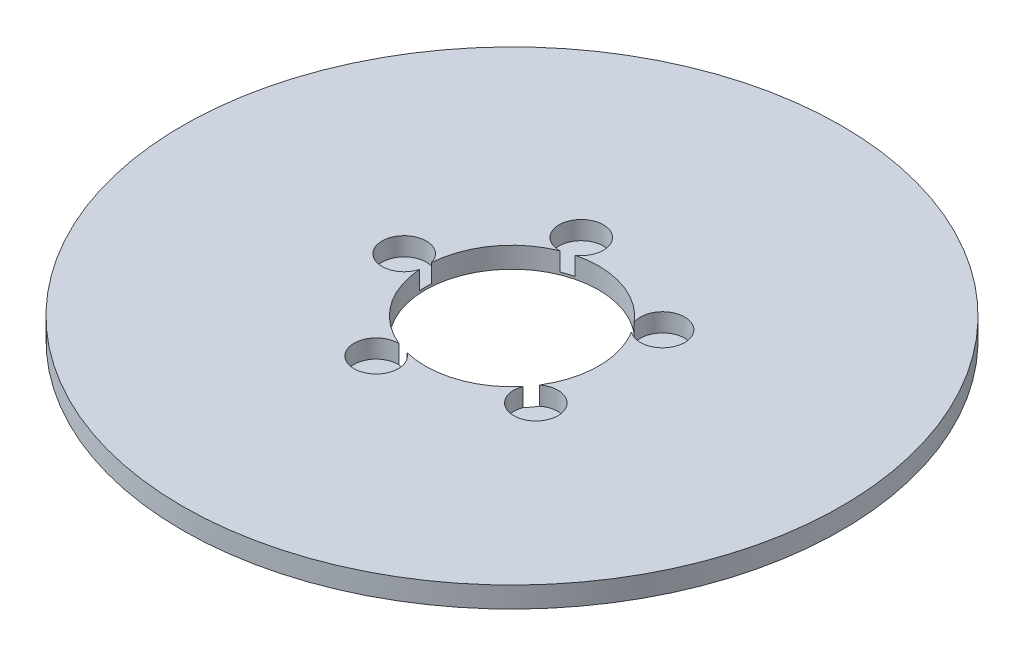
ISO-10303-21;
HEADER;
FILE_DESCRIPTION(('STEP AP214'),'2;1');
FILE_NAME('part.step','',(''),(''),'','','');
FILE_SCHEMA(('AUTOMOTIVE_DESIGN { 1 0 10303 214 1 1 1 1 }'));
ENDSEC;
DATA;
#1=APPLICATION_CONTEXT('core data for automotive mechanical design processes');
#2=APPLICATION_PROTOCOL_DEFINITION('international standard','automotive_design',2000,#1);
#3=PRODUCT_CONTEXT('',#1,'mechanical');
#4=PRODUCT('Part','Part','',(#3));
#5=PRODUCT_RELATED_PRODUCT_CATEGORY('part','',(#4));
#6=PRODUCT_DEFINITION_FORMATION('','',#4);
#7=PRODUCT_DEFINITION_CONTEXT('part definition',#1,'design');
#8=PRODUCT_DEFINITION('design','',#6,#7);
#9=PRODUCT_DEFINITION_SHAPE('','',#8);
#10=(LENGTH_UNIT() NAMED_UNIT(*) SI_UNIT(.MILLI.,.METRE.));
#11=(NAMED_UNIT(*) PLANE_ANGLE_UNIT() SI_UNIT($,.RADIAN.));
#12=(NAMED_UNIT(*) SI_UNIT($,.STERADIAN.) SOLID_ANGLE_UNIT());
#13=UNCERTAINTY_MEASURE_WITH_UNIT(LENGTH_MEASURE(1.E-05),#10,'distance_accuracy_value','');
#14=(GEOMETRIC_REPRESENTATION_CONTEXT(3) GLOBAL_UNCERTAINTY_ASSIGNED_CONTEXT((#13)) GLOBAL_UNIT_ASSIGNED_CONTEXT((#10,
#11,#12)) REPRESENTATION_CONTEXT('',''));
#15=CARTESIAN_POINT('',(0.,0.,0.));
#16=DIRECTION('',(0.,0.,1.));
#17=DIRECTION('',(1.,0.,0.));
#18=AXIS2_PLACEMENT_3D('',#15,#16,#17);
#19=CARTESIAN_POINT('',(0.,6.,0.));
#20=DIRECTION('',(0.,-1.,0.));
#21=DIRECTION('',(0.,0.,-1.));
#22=AXIS2_PLACEMENT_3D('',#19,#20,#21);
#23=CYLINDRICAL_SURFACE('',#22,95.);
#24=CARTESIAN_POINT('',(0.,6.,0.));
#25=DIRECTION('',(0.,1.,0.));
#26=DIRECTION('',(0.,0.,1.));
#27=AXIS2_PLACEMENT_3D('',#24,#25,#26);
#28=CIRCLE('',#27,95.);
#29=CARTESIAN_POINT('',(0.,6.,95.));
#30=VERTEX_POINT('',#29);
#31=EDGE_CURVE('E157',#30,#30,#28,.T.);
#32=ORIENTED_EDGE('',*,*,#31,.F.);
#33=EDGE_LOOP('',(#32));
#34=FACE_BOUND('',#33,.T.);
#35=CARTESIAN_POINT('',(0.,0.,0.));
#36=DIRECTION('',(0.,1.,0.));
#37=DIRECTION('',(0.,0.,1.));
#38=AXIS2_PLACEMENT_3D('',#35,#36,#37);
#39=CIRCLE('',#38,95.);
#40=CARTESIAN_POINT('',(0.,0.,95.));
#41=VERTEX_POINT('',#40);
#42=EDGE_CURVE('E150',#41,#41,#39,.T.);
#43=ORIENTED_EDGE('',*,*,#42,.T.);
#44=EDGE_LOOP('',(#43));
#45=FACE_BOUND('',#44,.T.);
#46=ADVANCED_FACE('F39',(#34,#45),#23,.T.);
#47=CARTESIAN_POINT('',(0.,6.,0.));
#48=DIRECTION('',(0.,1.,0.));
#49=DIRECTION('',(0.,0.,1.));
#50=AXIS2_PLACEMENT_3D('',#47,#48,#49);
#51=PLANE('',#50);
#52=CARTESIAN_POINT('',(-9.60448400432679,6.,-29.5595623031785));
#53=DIRECTION('',(0.,1.,0.));
#54=DIRECTION('',(-0.95105651629515,0.,0.309016994374958));
#55=AXIS2_PLACEMENT_3D('',#52,#53,#54);
#56=CIRCLE('',#55,6.37747740804192);
#57=CARTESIAN_POINT('',(-6.06808372666005,6.,-24.2523887459822));
#58=VERTEX_POINT('',#57);
#59=CARTESIAN_POINT('',(-9.34601357959476,6.,-23.1873247738938));
#60=VERTEX_POINT('',#59);
#61=EDGE_CURVE('E194',#58,#60,#56,.T.);
#62=ORIENTED_EDGE('',*,*,#61,.F.);
#63=CARTESIAN_POINT('',(0.,6.,0.));
#64=DIRECTION('',(0.,1.,0.));
#65=DIRECTION('',(0.,0.,1.));
#66=AXIS2_PLACEMENT_3D('',#63,#64,#65);
#67=CIRCLE('',#66,25.);
#68=CARTESIAN_POINT('',(19.16437929591,6.,-16.053864525481));
#69=VERTEX_POINT('',#68);
#70=EDGE_CURVE('E147',#69,#58,#67,.T.);
#71=ORIENTED_EDGE('',*,*,#70,.F.);
#72=CARTESIAN_POINT('',(25.1448655677312,6.,-18.2688141959347));
#73=DIRECTION('',(0.,1.,0.));
#74=DIRECTION('',(-0.58778525229248,0.,-0.809016994374942));
#75=AXIS2_PLACEMENT_3D('',#72,#73,#74);
#76=CIRCLE('',#75,6.37747740804192);
#77=CARTESIAN_POINT('',(21.1902513577616,6.,-13.2654908463608));
#78=VERTEX_POINT('',#77);
#79=EDGE_CURVE('E254',#78,#69,#76,.T.);
#80=ORIENTED_EDGE('',*,*,#79,.F.);
#81=CARTESIAN_POINT('',(21.1902513577618,6.,13.2654908463605));
#82=VERTEX_POINT('',#81);
#83=EDGE_CURVE('E144',#82,#78,#67,.T.);
#84=ORIENTED_EDGE('',*,*,#83,.F.);
#85=CARTESIAN_POINT('',(25.1448655677315,6.,18.2688141959344));
#86=DIRECTION('',(0.,1.,0.));
#87=DIRECTION('',(0.587785252292469,0.,-0.809016994374951));
#88=AXIS2_PLACEMENT_3D('',#85,#86,#87);
#89=CIRCLE('',#88,6.37747740804192);
#90=CARTESIAN_POINT('',(19.1643792959102,6.,16.0538645254807));
#91=VERTEX_POINT('',#90);
#92=EDGE_CURVE('E141',#91,#82,#89,.T.);
#93=ORIENTED_EDGE('',*,*,#92,.F.);
#94=CARTESIAN_POINT('',(-6.06808372665973,6.,24.2523887459823));
#95=VERTEX_POINT('',#94);
#96=EDGE_CURVE('E134',#95,#91,#67,.T.);
#97=ORIENTED_EDGE('',*,*,#96,.F.);
#98=CARTESIAN_POINT('',(-9.60448400432638,6.,29.5595623031786));
#99=DIRECTION('',(0.,1.,0.));
#100=DIRECTION('',(0.951056516295155,0.,0.309016994374945));
#101=AXIS2_PLACEMENT_3D('',#98,#99,#100);
#102=CIRCLE('',#101,6.37747740804192);
#103=CARTESIAN_POINT('',(-9.34601357959441,6.,23.187324773894));
#104=VERTEX_POINT('',#103);
#105=EDGE_CURVE('E111',#104,#95,#102,.T.);
#106=ORIENTED_EDGE('',*,*,#105,.F.);
#107=CARTESIAN_POINT('',(-24.9405333474176,6.,1.72330970703188));
#108=VERTEX_POINT('',#107);
#109=EDGE_CURVE('E145',#108,#104,#67,.T.);
#110=ORIENTED_EDGE('',*,*,#109,.F.);
#111=CARTESIAN_POINT('',(-31.0807631268098,6.,0.));
#112=DIRECTION('',(0.,1.,0.));
#113=DIRECTION('',(0.,0.,1.));
#114=AXIS2_PLACEMENT_3D('',#111,#112,#113);
#115=CIRCLE('',#114,6.37747740804192);
#116=CARTESIAN_POINT('',(-24.9405333474176,6.,-1.72330970703188));
#117=VERTEX_POINT('',#116);
#118=EDGE_CURVE('E153',#117,#108,#115,.T.);
#119=ORIENTED_EDGE('',*,*,#118,.F.);
#120=EDGE_CURVE('E146',#60,#117,#67,.T.);
#121=ORIENTED_EDGE('',*,*,#120,.F.);
#122=EDGE_LOOP('',(#62,#71,#80,#84,#93,#97,#106,#110,#119,#121));
#123=FACE_BOUND('',#122,.T.);
#124=ORIENTED_EDGE('',*,*,#31,.T.);
#125=EDGE_LOOP('',(#124));
#126=FACE_BOUND('',#125,.T.);
#127=ADVANCED_FACE('F139',(#123,#126),#51,.T.);
#128=CARTESIAN_POINT('',(0.,0.,0.));
#129=DIRECTION('',(0.,1.,0.));
#130=DIRECTION('',(0.,0.,1.));
#131=AXIS2_PLACEMENT_3D('',#128,#129,#130);
#132=PLANE('',#131);
#133=CARTESIAN_POINT('',(0.,0.,0.));
#134=DIRECTION('',(0.,1.,0.));
#135=DIRECTION('',(0.,0.,1.));
#136=AXIS2_PLACEMENT_3D('',#133,#134,#135);
#137=CIRCLE('',#136,25.);
#138=CARTESIAN_POINT('',(0.,0.,25.));
#139=VERTEX_POINT('',#138);
#140=EDGE_CURVE('E154',#139,#139,#137,.T.);
#141=ORIENTED_EDGE('',*,*,#140,.T.);
#142=EDGE_LOOP('',(#141));
#143=FACE_BOUND('',#142,.T.);
#144=ORIENTED_EDGE('',*,*,#42,.F.);
#145=EDGE_LOOP('',(#144));
#146=FACE_BOUND('',#145,.T.);
#147=ADVANCED_FACE('F213',(#143,#146),#132,.F.);
#148=CARTESIAN_POINT('',(0.,6.,0.));
#149=DIRECTION('',(0.,-1.,0.));
#150=DIRECTION('',(0.,0.,-1.));
#151=AXIS2_PLACEMENT_3D('',#148,#149,#150);
#152=CYLINDRICAL_SURFACE('',#151,25.);
#153=DIRECTION('',(0.,1.,0.));
#154=VECTOR('',#153,1.);
#155=CARTESIAN_POINT('',(-6.06808372666005,3.35191966016645,-24.2523887459822));
#156=LINE('',#155,#154);
#157=CARTESIAN_POINT('',(-6.06808372666005,0.7038393203329,-24.2523887459822));
#158=VERTEX_POINT('',#157);
#159=EDGE_CURVE('E11',#158,#58,#156,.T.);
#160=ORIENTED_EDGE('',*,*,#159,.F.);
#161=CARTESIAN_POINT('',(0.,0.7038393203329,0.));
#162=DIRECTION('',(0.,1.,0.));
#163=DIRECTION('',(0.,0.,1.));
#164=AXIS2_PLACEMENT_3D('',#161,#162,#163);
#165=CIRCLE('',#164,25.);
#166=CARTESIAN_POINT('',(-9.34601357959476,0.7038393203329,-23.1873247738938));
#167=VERTEX_POINT('',#166);
#168=EDGE_CURVE('E189',#158,#167,#165,.T.);
#169=ORIENTED_EDGE('',*,*,#168,.T.);
#170=DIRECTION('',(0.,1.,0.));
#171=VECTOR('',#170,1.);
#172=CARTESIAN_POINT('',(-9.34601357959476,3.35191966016645,-23.1873247738938));
#173=LINE('',#172,#171);
#174=EDGE_CURVE('E46',#60,#167,#173,.F.);
#175=ORIENTED_EDGE('',*,*,#174,.F.);
#176=ORIENTED_EDGE('',*,*,#120,.T.);
#177=DIRECTION('',(0.,1.,0.));
#178=VECTOR('',#177,1.);
#179=CARTESIAN_POINT('',(-24.9405333474176,3.35191966016645,-1.72330970703188));
#180=LINE('',#179,#178);
#181=CARTESIAN_POINT('',(-24.9405333474176,0.7038393203329,-1.72330970703188));
#182=VERTEX_POINT('',#181);
#183=EDGE_CURVE('E168',#182,#117,#180,.T.);
#184=ORIENTED_EDGE('',*,*,#183,.F.);
#185=CARTESIAN_POINT('',(0.,0.7038393203329,0.));
#186=DIRECTION('',(0.,1.,0.));
#187=DIRECTION('',(0.,0.,1.));
#188=AXIS2_PLACEMENT_3D('',#185,#186,#187);
#189=CIRCLE('',#188,25.);
#190=CARTESIAN_POINT('',(-24.9405333474176,0.7038393203329,1.72330970703188));
#191=VERTEX_POINT('',#190);
#192=EDGE_CURVE('E165',#182,#191,#189,.T.);
#193=ORIENTED_EDGE('',*,*,#192,.T.);
#194=DIRECTION('',(0.,1.,0.));
#195=VECTOR('',#194,1.);
#196=CARTESIAN_POINT('',(-24.9405333474176,3.35191966016645,1.72330970703188));
#197=LINE('',#196,#195);
#198=EDGE_CURVE('E170',#108,#191,#197,.F.);
#199=ORIENTED_EDGE('',*,*,#198,.F.);
#200=ORIENTED_EDGE('',*,*,#109,.T.);
#201=DIRECTION('',(0.,1.,0.));
#202=VECTOR('',#201,1.);
#203=CARTESIAN_POINT('',(-9.34601357959444,3.35191966016645,23.187324773894));
#204=LINE('',#203,#202);
#205=CARTESIAN_POINT('',(-9.34601357959441,0.7038393203329,23.187324773894));
#206=VERTEX_POINT('',#205);
#207=EDGE_CURVE('E121',#206,#104,#204,.T.);
#208=ORIENTED_EDGE('',*,*,#207,.F.);
#209=CARTESIAN_POINT('',(0.,0.7038393203329,0.));
#210=DIRECTION('',(0.,1.,0.));
#211=DIRECTION('',(0.,0.,1.));
#212=AXIS2_PLACEMENT_3D('',#209,#210,#211);
#213=CIRCLE('',#212,25.);
#214=CARTESIAN_POINT('',(-6.06808372665973,0.7038393203329,24.2523887459823));
#215=VERTEX_POINT('',#214);
#216=EDGE_CURVE('E136',#206,#215,#213,.T.);
#217=ORIENTED_EDGE('',*,*,#216,.T.);
#218=DIRECTION('',(0.,1.,0.));
#219=VECTOR('',#218,1.);
#220=CARTESIAN_POINT('',(-6.06808372665971,3.35191966016645,24.2523887459823));
#221=LINE('',#220,#219);
#222=EDGE_CURVE('E117',#95,#215,#221,.F.);
#223=ORIENTED_EDGE('',*,*,#222,.F.);
#224=ORIENTED_EDGE('',*,*,#96,.T.);
#225=DIRECTION('',(0.,1.,0.));
#226=VECTOR('',#225,1.);
#227=CARTESIAN_POINT('',(19.1643792959102,3.35191966016645,16.0538645254807));
#228=LINE('',#227,#226);
#229=CARTESIAN_POINT('',(19.1643792959102,0.7038393203329,16.0538645254807));
#230=VERTEX_POINT('',#229);
#231=EDGE_CURVE('E182',#230,#91,#228,.T.);
#232=ORIENTED_EDGE('',*,*,#231,.F.);
#233=CARTESIAN_POINT('',(0.,0.7038393203329,0.));
#234=DIRECTION('',(0.,1.,0.));
#235=DIRECTION('',(0.,0.,1.));
#236=AXIS2_PLACEMENT_3D('',#233,#234,#235);
#237=CIRCLE('',#236,25.);
#238=CARTESIAN_POINT('',(21.1902513577618,0.7038393203329,13.2654908463605));
#239=VERTEX_POINT('',#238);
#240=EDGE_CURVE('E174',#230,#239,#237,.T.);
#241=ORIENTED_EDGE('',*,*,#240,.T.);
#242=DIRECTION('',(0.,1.,0.));
#243=VECTOR('',#242,1.);
#244=CARTESIAN_POINT('',(21.1902513577618,3.35191966016645,13.2654908463605));
#245=LINE('',#244,#243);
#246=EDGE_CURVE('E177',#82,#239,#245,.F.);
#247=ORIENTED_EDGE('',*,*,#246,.F.);
#248=ORIENTED_EDGE('',*,*,#83,.T.);
#249=DIRECTION('',(0.,1.,0.));
#250=VECTOR('',#249,1.);
#251=CARTESIAN_POINT('',(21.1902513577616,3.35191966016645,-13.2654908463608));
#252=LINE('',#251,#250);
#253=CARTESIAN_POINT('',(21.1902513577616,0.7038393203329,-13.2654908463608));
#254=VERTEX_POINT('',#253);
#255=EDGE_CURVE('E187',#254,#78,#252,.T.);
#256=ORIENTED_EDGE('',*,*,#255,.F.);
#257=CARTESIAN_POINT('',(0.,0.7038393203329,0.));
#258=DIRECTION('',(0.,1.,0.));
#259=DIRECTION('',(0.,0.,1.));
#260=AXIS2_PLACEMENT_3D('',#257,#258,#259);
#261=CIRCLE('',#260,25.);
#262=CARTESIAN_POINT('',(19.16437929591,0.7038393203329,-16.053864525481));
#263=VERTEX_POINT('',#262);
#264=EDGE_CURVE('E181',#254,#263,#261,.T.);
#265=ORIENTED_EDGE('',*,*,#264,.T.);
#266=DIRECTION('',(0.,1.,0.));
#267=VECTOR('',#266,1.);
#268=CARTESIAN_POINT('',(19.16437929591,3.35191966016645,-16.053864525481));
#269=LINE('',#268,#267);
#270=EDGE_CURVE('E186',#69,#263,#269,.F.);
#271=ORIENTED_EDGE('',*,*,#270,.F.);
#272=ORIENTED_EDGE('',*,*,#70,.T.);
#273=EDGE_LOOP('',(#160,#169,#175,#176,#184,#193,#199,#200,#208,#217,#223,#224,#232,#241,#247,
#248,#256,#265,#271,#272));
#274=FACE_BOUND('',#273,.T.);
#275=ORIENTED_EDGE('',*,*,#140,.F.);
#276=EDGE_LOOP('',(#275));
#277=FACE_BOUND('',#276,.T.);
#278=ADVANCED_FACE('F135',(#274,#277),#152,.F.);
#279=CARTESIAN_POINT('',(-31.0807631268098,0.7038393203329,0.));
#280=DIRECTION('',(0.,1.,0.));
#281=DIRECTION('',(0.,0.,1.));
#282=AXIS2_PLACEMENT_3D('',#279,#280,#281);
#283=CYLINDRICAL_SURFACE('',#282,6.37747740804192);
#284=ORIENTED_EDGE('',*,*,#183,.T.);
#285=ORIENTED_EDGE('',*,*,#118,.T.);
#286=ORIENTED_EDGE('',*,*,#198,.T.);
#287=CARTESIAN_POINT('',(-31.0807631268098,0.7038393203329,0.));
#288=DIRECTION('',(0.,1.,0.));
#289=DIRECTION('',(0.,0.,1.));
#290=AXIS2_PLACEMENT_3D('',#287,#288,#289);
#291=CIRCLE('',#290,6.37747740804192);
#292=EDGE_CURVE('E158',#182,#191,#291,.T.);
#293=ORIENTED_EDGE('',*,*,#292,.F.);
#294=EDGE_LOOP('',(#284,#285,#286,#293));
#295=FACE_BOUND('',#294,.T.);
#296=ADVANCED_FACE('F221',(#295),#283,.F.);
#297=CARTESIAN_POINT('',(-31.0807631268098,0.7038393203329,0.));
#298=DIRECTION('',(0.,1.,0.));
#299=DIRECTION('',(0.,0.,1.));
#300=AXIS2_PLACEMENT_3D('',#297,#298,#299);
#301=PLANE('',#300);
#302=ORIENTED_EDGE('',*,*,#292,.T.);
#303=ORIENTED_EDGE('',*,*,#192,.F.);
#304=EDGE_LOOP('',(#302,#303));
#305=FACE_BOUND('',#304,.T.);
#306=ADVANCED_FACE('F227',(#305),#301,.T.);
#307=CARTESIAN_POINT('',(-9.60448400432638,0.7038393203329,29.5595623031786));
#308=DIRECTION('',(0.,1.,0.));
#309=DIRECTION('',(0.,0.,1.));
#310=AXIS2_PLACEMENT_3D('',#307,#308,#309);
#311=CYLINDRICAL_SURFACE('',#310,6.37747740804192);
#312=ORIENTED_EDGE('',*,*,#207,.T.);
#313=ORIENTED_EDGE('',*,*,#105,.T.);
#314=ORIENTED_EDGE('',*,*,#222,.T.);
#315=CARTESIAN_POINT('',(-9.60448400432638,0.7038393203329,29.5595623031786));
#316=DIRECTION('',(0.,1.,0.));
#317=DIRECTION('',(0.951056516295155,0.,0.309016994374945));
#318=AXIS2_PLACEMENT_3D('',#315,#316,#317);
#319=CIRCLE('',#318,6.37747740804192);
#320=EDGE_CURVE('E127',#206,#215,#319,.T.);
#321=ORIENTED_EDGE('',*,*,#320,.F.);
#322=EDGE_LOOP('',(#312,#313,#314,#321));
#323=FACE_BOUND('',#322,.T.);
#324=ADVANCED_FACE('F116',(#323),#311,.F.);
#325=CARTESIAN_POINT('',(-9.60448400432638,0.7038393203329,29.5595623031786));
#326=DIRECTION('',(0.,1.,0.));
#327=DIRECTION('',(0.951056516295155,0.,0.309016994374945));
#328=AXIS2_PLACEMENT_3D('',#325,#326,#327);
#329=PLANE('',#328);
#330=ORIENTED_EDGE('',*,*,#320,.T.);
#331=ORIENTED_EDGE('',*,*,#216,.F.);
#332=EDGE_LOOP('',(#330,#331));
#333=FACE_BOUND('',#332,.T.);
#334=ADVANCED_FACE('F234',(#333),#329,.T.);
#335=CARTESIAN_POINT('',(25.1448655677315,0.7038393203329,18.2688141959344));
#336=DIRECTION('',(0.,1.,0.));
#337=DIRECTION('',(0.,0.,1.));
#338=AXIS2_PLACEMENT_3D('',#335,#336,#337);
#339=CYLINDRICAL_SURFACE('',#338,6.37747740804192);
#340=ORIENTED_EDGE('',*,*,#231,.T.);
#341=ORIENTED_EDGE('',*,*,#92,.T.);
#342=ORIENTED_EDGE('',*,*,#246,.T.);
#343=CARTESIAN_POINT('',(25.1448655677315,0.7038393203329,18.2688141959344));
#344=DIRECTION('',(0.,1.,0.));
#345=DIRECTION('',(0.587785252292469,0.,-0.809016994374951));
#346=AXIS2_PLACEMENT_3D('',#343,#344,#345);
#347=CIRCLE('',#346,6.37747740804192);
#348=EDGE_CURVE('E130',#230,#239,#347,.T.);
#349=ORIENTED_EDGE('',*,*,#348,.F.);
#350=EDGE_LOOP('',(#340,#341,#342,#349));
#351=FACE_BOUND('',#350,.T.);
#352=ADVANCED_FACE('F240',(#351),#339,.F.);
#353=CARTESIAN_POINT('',(25.1448655677315,0.7038393203329,18.2688141959344));
#354=DIRECTION('',(0.,1.,0.));
#355=DIRECTION('',(0.587785252292469,0.,-0.809016994374951));
#356=AXIS2_PLACEMENT_3D('',#353,#354,#355);
#357=PLANE('',#356);
#358=ORIENTED_EDGE('',*,*,#348,.T.);
#359=ORIENTED_EDGE('',*,*,#240,.F.);
#360=EDGE_LOOP('',(#358,#359));
#361=FACE_BOUND('',#360,.T.);
#362=ADVANCED_FACE('F245',(#361),#357,.T.);
#363=CARTESIAN_POINT('',(25.1448655677312,0.7038393203329,-18.2688141959347));
#364=DIRECTION('',(0.,1.,0.));
#365=DIRECTION('',(0.,0.,1.));
#366=AXIS2_PLACEMENT_3D('',#363,#364,#365);
#367=CYLINDRICAL_SURFACE('',#366,6.37747740804192);
#368=ORIENTED_EDGE('',*,*,#255,.T.);
#369=ORIENTED_EDGE('',*,*,#79,.T.);
#370=ORIENTED_EDGE('',*,*,#270,.T.);
#371=CARTESIAN_POINT('',(25.1448655677312,0.7038393203329,-18.2688141959347));
#372=DIRECTION('',(0.,1.,0.));
#373=DIRECTION('',(-0.58778525229248,0.,-0.809016994374942));
#374=AXIS2_PLACEMENT_3D('',#371,#372,#373);
#375=CIRCLE('',#374,6.37747740804192);
#376=EDGE_CURVE('E56',#254,#263,#375,.T.);
#377=ORIENTED_EDGE('',*,*,#376,.F.);
#378=EDGE_LOOP('',(#368,#369,#370,#377));
#379=FACE_BOUND('',#378,.T.);
#380=ADVANCED_FACE('F266',(#379),#367,.F.);
#381=CARTESIAN_POINT('',(25.1448655677312,0.7038393203329,-18.2688141959347));
#382=DIRECTION('',(0.,1.,0.));
#383=DIRECTION('',(-0.58778525229248,0.,-0.809016994374942));
#384=AXIS2_PLACEMENT_3D('',#381,#382,#383);
#385=PLANE('',#384);
#386=ORIENTED_EDGE('',*,*,#376,.T.);
#387=ORIENTED_EDGE('',*,*,#264,.F.);
#388=EDGE_LOOP('',(#386,#387));
#389=FACE_BOUND('',#388,.T.);
#390=ADVANCED_FACE('F204',(#389),#385,.T.);
#391=CARTESIAN_POINT('',(-9.60448400432679,0.7038393203329,-29.5595623031785));
#392=DIRECTION('',(0.,1.,0.));
#393=DIRECTION('',(0.,0.,1.));
#394=AXIS2_PLACEMENT_3D('',#391,#392,#393);
#395=CYLINDRICAL_SURFACE('',#394,6.37747740804192);
#396=ORIENTED_EDGE('',*,*,#159,.T.);
#397=ORIENTED_EDGE('',*,*,#61,.T.);
#398=ORIENTED_EDGE('',*,*,#174,.T.);
#399=CARTESIAN_POINT('',(-9.60448400432679,0.7038393203329,-29.5595623031785));
#400=DIRECTION('',(0.,1.,0.));
#401=DIRECTION('',(-0.95105651629515,0.,0.309016994374958));
#402=AXIS2_PLACEMENT_3D('',#399,#400,#401);
#403=CIRCLE('',#402,6.37747740804192);
#404=EDGE_CURVE('E55',#158,#167,#403,.T.);
#405=ORIENTED_EDGE('',*,*,#404,.F.);
#406=EDGE_LOOP('',(#396,#397,#398,#405));
#407=FACE_BOUND('',#406,.T.);
#408=ADVANCED_FACE('F193',(#407),#395,.F.);
#409=CARTESIAN_POINT('',(-9.60448400432679,0.7038393203329,-29.5595623031785));
#410=DIRECTION('',(0.,1.,0.));
#411=DIRECTION('',(-0.95105651629515,0.,0.309016994374958));
#412=AXIS2_PLACEMENT_3D('',#409,#410,#411);
#413=PLANE('',#412);
#414=ORIENTED_EDGE('',*,*,#404,.T.);
#415=ORIENTED_EDGE('',*,*,#168,.F.);
#416=EDGE_LOOP('',(#414,#415));
#417=FACE_BOUND('',#416,.T.);
#418=ADVANCED_FACE('F196',(#417),#413,.T.);
#419=CLOSED_SHELL('',(#46,#127,#147,#278,#296,#306,#324,#334,#352,#362,#380,#390,#408,#418));
#420=MANIFOLD_SOLID_BREP('B2',#419);
#421=ADVANCED_BREP_SHAPE_REPRESENTATION('',(#18,#420),#14);
#422=SHAPE_DEFINITION_REPRESENTATION(#9,#421);
ENDSEC;
END-ISO-10303-21;
